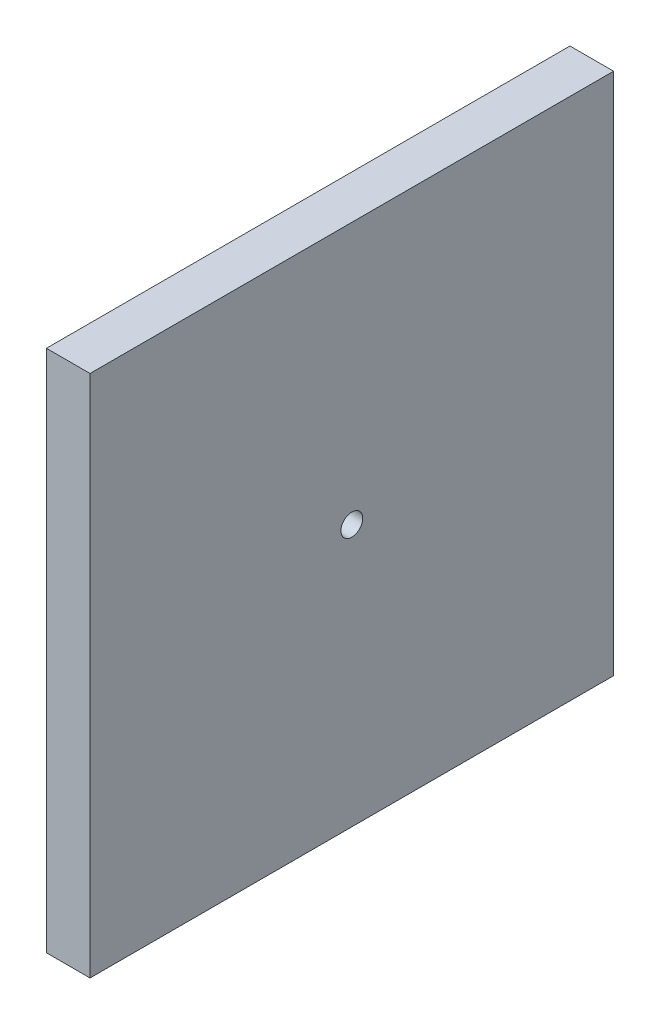
ISO-10303-21;
HEADER;
FILE_DESCRIPTION(('STEP AP214'),'2;1');
FILE_NAME('part.step','',(''),(''),'','','');
FILE_SCHEMA(('AUTOMOTIVE_DESIGN { 1 0 10303 214 1 1 1 1 }'));
ENDSEC;
DATA;
#1=APPLICATION_CONTEXT('core data for automotive mechanical design processes');
#2=APPLICATION_PROTOCOL_DEFINITION('international standard','automotive_design',2000,#1);
#3=PRODUCT_CONTEXT('',#1,'mechanical');
#4=PRODUCT('Part','Part','',(#3));
#5=PRODUCT_RELATED_PRODUCT_CATEGORY('part','',(#4));
#6=PRODUCT_DEFINITION_FORMATION('','',#4);
#7=PRODUCT_DEFINITION_CONTEXT('part definition',#1,'design');
#8=PRODUCT_DEFINITION('design','',#6,#7);
#9=PRODUCT_DEFINITION_SHAPE('','',#8);
#10=(LENGTH_UNIT() NAMED_UNIT(*) SI_UNIT(.MILLI.,.METRE.));
#11=(NAMED_UNIT(*) PLANE_ANGLE_UNIT() SI_UNIT($,.RADIAN.));
#12=(NAMED_UNIT(*) SI_UNIT($,.STERADIAN.) SOLID_ANGLE_UNIT());
#13=UNCERTAINTY_MEASURE_WITH_UNIT(LENGTH_MEASURE(1.E-05),#10,'distance_accuracy_value','');
#14=(GEOMETRIC_REPRESENTATION_CONTEXT(3) GLOBAL_UNCERTAINTY_ASSIGNED_CONTEXT((#13)) GLOBAL_UNIT_ASSIGNED_CONTEXT((#10,
#11,#12)) REPRESENTATION_CONTEXT('',''));
#15=CARTESIAN_POINT('',(0.,0.,0.));
#16=DIRECTION('',(0.,0.,1.));
#17=DIRECTION('',(1.,0.,0.));
#18=AXIS2_PLACEMENT_3D('',#15,#16,#17);
#19=CARTESIAN_POINT('',(12.7,-152.4,-152.4));
#20=DIRECTION('',(0.,0.,1.));
#21=DIRECTION('',(1.,0.,0.));
#22=AXIS2_PLACEMENT_3D('',#19,#20,#21);
#23=PLANE('',#22);
#24=DIRECTION('',(0.,1.,0.));
#25=VECTOR('',#24,1.);
#26=CARTESIAN_POINT('',(-12.7,-152.4,-152.4));
#27=LINE('',#26,#25);
#28=CARTESIAN_POINT('',(-12.7,-152.4,-152.4));
#29=VERTEX_POINT('',#28);
#30=CARTESIAN_POINT('',(-12.7,152.4,-152.4));
#31=VERTEX_POINT('',#30);
#32=EDGE_CURVE('E98',#29,#31,#27,.T.);
#33=ORIENTED_EDGE('',*,*,#32,.T.);
#34=DIRECTION('',(-1.,0.,0.));
#35=VECTOR('',#34,1.);
#36=CARTESIAN_POINT('',(12.7,152.4,-152.4));
#37=LINE('',#36,#35);
#38=CARTESIAN_POINT('',(12.7,152.4,-152.4));
#39=VERTEX_POINT('',#38);
#40=EDGE_CURVE('E11',#39,#31,#37,.T.);
#41=ORIENTED_EDGE('',*,*,#40,.F.);
#42=DIRECTION('',(0.,1.,0.));
#43=VECTOR('',#42,1.);
#44=CARTESIAN_POINT('',(12.7,-152.4,-152.4));
#45=LINE('',#44,#43);
#46=CARTESIAN_POINT('',(12.7,-152.4,-152.4));
#47=VERTEX_POINT('',#46);
#48=EDGE_CURVE('E86',#47,#39,#45,.T.);
#49=ORIENTED_EDGE('',*,*,#48,.F.);
#50=DIRECTION('',(-1.,0.,0.));
#51=VECTOR('',#50,1.);
#52=CARTESIAN_POINT('',(12.7,-152.4,-152.4));
#53=LINE('',#52,#51);
#54=EDGE_CURVE('E94',#47,#29,#53,.T.);
#55=ORIENTED_EDGE('',*,*,#54,.T.);
#56=EDGE_LOOP('',(#33,#41,#49,#55));
#57=FACE_BOUND('',#56,.T.);
#58=ADVANCED_FACE('F35',(#57),#23,.F.);
#59=CARTESIAN_POINT('',(12.7,152.4,152.4));
#60=DIRECTION('',(0.,-1.,0.));
#61=DIRECTION('',(0.,0.,-1.));
#62=AXIS2_PLACEMENT_3D('',#59,#60,#61);
#63=PLANE('',#62);
#64=DIRECTION('',(0.,0.,1.));
#65=VECTOR('',#64,1.);
#66=CARTESIAN_POINT('',(-12.7,152.4,152.4));
#67=LINE('',#66,#65);
#68=CARTESIAN_POINT('',(-12.7,152.4,152.4));
#69=VERTEX_POINT('',#68);
#70=EDGE_CURVE('E90',#31,#69,#67,.T.);
#71=ORIENTED_EDGE('',*,*,#70,.T.);
#72=DIRECTION('',(-1.,0.,0.));
#73=VECTOR('',#72,1.);
#74=CARTESIAN_POINT('',(12.7,152.4,152.4));
#75=LINE('',#74,#73);
#76=CARTESIAN_POINT('',(12.7,152.4,152.4));
#77=VERTEX_POINT('',#76);
#78=EDGE_CURVE('E43',#77,#69,#75,.T.);
#79=ORIENTED_EDGE('',*,*,#78,.F.);
#80=DIRECTION('',(0.,0.,1.));
#81=VECTOR('',#80,1.);
#82=CARTESIAN_POINT('',(12.7,152.4,152.4));
#83=LINE('',#82,#81);
#84=EDGE_CURVE('E81',#39,#77,#83,.T.);
#85=ORIENTED_EDGE('',*,*,#84,.F.);
#86=ORIENTED_EDGE('',*,*,#40,.T.);
#87=EDGE_LOOP('',(#71,#79,#85,#86));
#88=FACE_BOUND('',#87,.T.);
#89=ADVANCED_FACE('F89',(#88),#63,.F.);
#90=CARTESIAN_POINT('',(12.7,-152.4,152.4));
#91=DIRECTION('',(0.,0.,-1.));
#92=DIRECTION('',(-1.,0.,0.));
#93=AXIS2_PLACEMENT_3D('',#90,#91,#92);
#94=PLANE('',#93);
#95=DIRECTION('',(0.,-1.,0.));
#96=VECTOR('',#95,1.);
#97=CARTESIAN_POINT('',(-12.7,-152.4,152.4));
#98=LINE('',#97,#96);
#99=CARTESIAN_POINT('',(-12.7,-152.4,152.4));
#100=VERTEX_POINT('',#99);
#101=EDGE_CURVE('E68',#69,#100,#98,.T.);
#102=ORIENTED_EDGE('',*,*,#101,.T.);
#103=DIRECTION('',(-1.,0.,0.));
#104=VECTOR('',#103,1.);
#105=CARTESIAN_POINT('',(12.7,-152.4,152.4));
#106=LINE('',#105,#104);
#107=CARTESIAN_POINT('',(12.7,-152.4,152.4));
#108=VERTEX_POINT('',#107);
#109=EDGE_CURVE('E91',#108,#100,#106,.T.);
#110=ORIENTED_EDGE('',*,*,#109,.F.);
#111=DIRECTION('',(0.,-1.,0.));
#112=VECTOR('',#111,1.);
#113=CARTESIAN_POINT('',(12.7,-152.4,152.4));
#114=LINE('',#113,#112);
#115=EDGE_CURVE('E84',#77,#108,#114,.T.);
#116=ORIENTED_EDGE('',*,*,#115,.F.);
#117=ORIENTED_EDGE('',*,*,#78,.T.);
#118=EDGE_LOOP('',(#102,#110,#116,#117));
#119=FACE_BOUND('',#118,.T.);
#120=ADVANCED_FACE('F92',(#119),#94,.F.);
#121=CARTESIAN_POINT('',(12.7,-152.4,152.4));
#122=DIRECTION('',(0.,1.,0.));
#123=DIRECTION('',(0.,0.,1.));
#124=AXIS2_PLACEMENT_3D('',#121,#122,#123);
#125=PLANE('',#124);
#126=DIRECTION('',(0.,0.,-1.));
#127=VECTOR('',#126,1.);
#128=CARTESIAN_POINT('',(-12.7,-152.4,152.4));
#129=LINE('',#128,#127);
#130=EDGE_CURVE('E74',#100,#29,#129,.T.);
#131=ORIENTED_EDGE('',*,*,#130,.T.);
#132=ORIENTED_EDGE('',*,*,#54,.F.);
#133=DIRECTION('',(0.,0.,-1.));
#134=VECTOR('',#133,1.);
#135=CARTESIAN_POINT('',(12.7,-152.4,152.4));
#136=LINE('',#135,#134);
#137=EDGE_CURVE('E51',#108,#47,#136,.T.);
#138=ORIENTED_EDGE('',*,*,#137,.F.);
#139=ORIENTED_EDGE('',*,*,#109,.T.);
#140=EDGE_LOOP('',(#131,#132,#138,#139));
#141=FACE_BOUND('',#140,.T.);
#142=ADVANCED_FACE('F106',(#141),#125,.F.);
#143=CARTESIAN_POINT('',(12.7,0.,0.));
#144=DIRECTION('',(-1.,0.,0.));
#145=DIRECTION('',(0.,0.,1.));
#146=AXIS2_PLACEMENT_3D('',#143,#144,#145);
#147=PLANE('',#146);
#148=CARTESIAN_POINT('',(12.7,0.,0.));
#149=DIRECTION('',(1.,0.,0.));
#150=DIRECTION('',(0.,0.,-1.));
#151=AXIS2_PLACEMENT_3D('',#148,#149,#150);
#152=CIRCLE('',#151,6.35);
#153=CARTESIAN_POINT('',(12.7,0.,-6.35));
#154=VERTEX_POINT('',#153);
#155=EDGE_CURVE('E114',#154,#154,#152,.T.);
#156=ORIENTED_EDGE('',*,*,#155,.F.);
#157=EDGE_LOOP('',(#156));
#158=FACE_BOUND('',#157,.T.);
#159=ORIENTED_EDGE('',*,*,#48,.T.);
#160=ORIENTED_EDGE('',*,*,#84,.T.);
#161=ORIENTED_EDGE('',*,*,#115,.T.);
#162=ORIENTED_EDGE('',*,*,#137,.T.);
#163=EDGE_LOOP('',(#159,#160,#161,#162));
#164=FACE_BOUND('',#163,.T.);
#165=ADVANCED_FACE('F82',(#158,#164),#147,.F.);
#166=CARTESIAN_POINT('',(-12.7,0.,0.));
#167=DIRECTION('',(-1.,0.,0.));
#168=DIRECTION('',(0.,0.,1.));
#169=AXIS2_PLACEMENT_3D('',#166,#167,#168);
#170=PLANE('',#169);
#171=CARTESIAN_POINT('',(-12.7,0.,0.));
#172=DIRECTION('',(1.,0.,0.));
#173=DIRECTION('',(0.,0.,-1.));
#174=AXIS2_PLACEMENT_3D('',#171,#172,#173);
#175=CIRCLE('',#174,6.35);
#176=CARTESIAN_POINT('',(-12.7,0.,-6.35));
#177=VERTEX_POINT('',#176);
#178=EDGE_CURVE('E101',#177,#177,#175,.T.);
#179=ORIENTED_EDGE('',*,*,#178,.T.);
#180=EDGE_LOOP('',(#179));
#181=FACE_BOUND('',#180,.T.);
#182=ORIENTED_EDGE('',*,*,#32,.F.);
#183=ORIENTED_EDGE('',*,*,#130,.F.);
#184=ORIENTED_EDGE('',*,*,#101,.F.);
#185=ORIENTED_EDGE('',*,*,#70,.F.);
#186=EDGE_LOOP('',(#182,#183,#184,#185));
#187=FACE_BOUND('',#186,.T.);
#188=ADVANCED_FACE('F109',(#181,#187),#170,.T.);
#189=CARTESIAN_POINT('',(-12.7,0.,0.));
#190=DIRECTION('',(1.,0.,0.));
#191=DIRECTION('',(0.,0.,-1.));
#192=AXIS2_PLACEMENT_3D('',#189,#190,#191);
#193=CYLINDRICAL_SURFACE('',#192,6.35);
#194=ORIENTED_EDGE('',*,*,#178,.F.);
#195=EDGE_LOOP('',(#194));
#196=FACE_BOUND('',#195,.T.);
#197=ORIENTED_EDGE('',*,*,#155,.T.);
#198=EDGE_LOOP('',(#197));
#199=FACE_BOUND('',#198,.T.);
#200=ADVANCED_FACE('F118',(#196,#199),#193,.F.);
#201=CLOSED_SHELL('',(#58,#89,#120,#142,#165,#188,#200));
#202=MANIFOLD_SOLID_BREP('B2',#201);
#203=ADVANCED_BREP_SHAPE_REPRESENTATION('',(#18,#202),#14);
#204=SHAPE_DEFINITION_REPRESENTATION(#9,#203);
ENDSEC;
END-ISO-10303-21;
